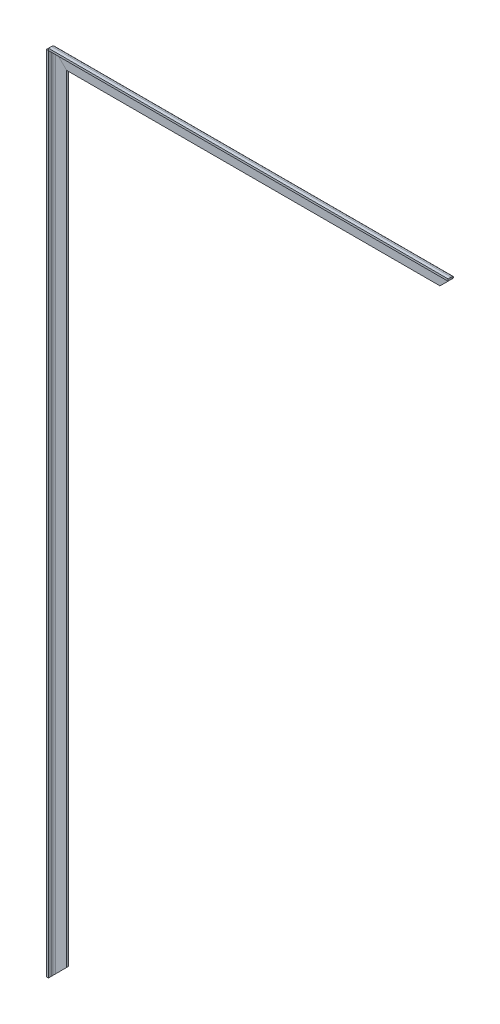
ISO-10303-21;
HEADER;
FILE_DESCRIPTION(('STEP AP214'),'2;1');
FILE_NAME('part.step','',(''),(''),'','','');
FILE_SCHEMA(('AUTOMOTIVE_DESIGN { 1 0 10303 214 1 1 1 1 }'));
ENDSEC;
DATA;
#1=APPLICATION_CONTEXT('core data for automotive mechanical design processes');
#2=APPLICATION_PROTOCOL_DEFINITION('international standard','automotive_design',2000,#1);
#3=PRODUCT_CONTEXT('',#1,'mechanical');
#4=PRODUCT('Part','Part','',(#3));
#5=PRODUCT_RELATED_PRODUCT_CATEGORY('part','',(#4));
#6=PRODUCT_DEFINITION_FORMATION('','',#4);
#7=PRODUCT_DEFINITION_CONTEXT('part definition',#1,'design');
#8=PRODUCT_DEFINITION('design','',#6,#7);
#9=PRODUCT_DEFINITION_SHAPE('','',#8);
#10=(LENGTH_UNIT() NAMED_UNIT(*) SI_UNIT(.MILLI.,.METRE.));
#11=(NAMED_UNIT(*) PLANE_ANGLE_UNIT() SI_UNIT($,.RADIAN.));
#12=(NAMED_UNIT(*) SI_UNIT($,.STERADIAN.) SOLID_ANGLE_UNIT());
#13=UNCERTAINTY_MEASURE_WITH_UNIT(LENGTH_MEASURE(1.E-05),#10,'distance_accuracy_value','');
#14=(GEOMETRIC_REPRESENTATION_CONTEXT(3) GLOBAL_UNCERTAINTY_ASSIGNED_CONTEXT((#13)) GLOBAL_UNIT_ASSIGNED_CONTEXT((#10,
#11,#12)) REPRESENTATION_CONTEXT('',''));
#15=CARTESIAN_POINT('',(0.,0.,0.));
#16=DIRECTION('',(0.,0.,1.));
#17=DIRECTION('',(1.,0.,0.));
#18=AXIS2_PLACEMENT_3D('',#15,#16,#17);
#19=CARTESIAN_POINT('',(212.481172589343,400.,-5.));
#20=DIRECTION('',(0.,0.,-1.));
#21=DIRECTION('',(0.,1.,0.));
#22=AXIS2_PLACEMENT_3D('',#19,#20,#21);
#23=PLANE('',#22);
#24=DIRECTION('',(0.707106781186547,0.707106781186548,0.));
#25=VECTOR('',#24,1.);
#26=CARTESIAN_POINT('',(206.240586294672,406.240586294672,-5.));
#27=LINE('',#26,#25);
#28=CARTESIAN_POINT('',(185.,385.,-5.));
#29=VERTEX_POINT('',#28);
#30=CARTESIAN_POINT('',(196.,396.,-5.));
#31=VERTEX_POINT('',#30);
#32=EDGE_CURVE('E82',#29,#31,#27,.T.);
#33=ORIENTED_EDGE('',*,*,#32,.T.);
#34=DIRECTION('',(-1.,0.,0.));
#35=VECTOR('',#34,1.);
#36=CARTESIAN_POINT('',(212.481172589343,396.,-5.));
#37=LINE('',#36,#35);
#38=CARTESIAN_POINT('',(-196.,396.,-5.));
#39=VERTEX_POINT('',#38);
#40=EDGE_CURVE('E130',#31,#39,#37,.T.);
#41=ORIENTED_EDGE('',*,*,#40,.T.);
#42=DIRECTION('',(0.707106781186548,-0.707106781186547,0.));
#43=VECTOR('',#42,1.);
#44=CARTESIAN_POINT('',(-206.240586294672,406.240586294672,-5.));
#45=LINE('',#44,#43);
#46=CARTESIAN_POINT('',(-185.,385.,-5.));
#47=VERTEX_POINT('',#46);
#48=EDGE_CURVE('E153',#39,#47,#45,.T.);
#49=ORIENTED_EDGE('',*,*,#48,.T.);
#50=DIRECTION('',(-1.,0.,0.));
#51=VECTOR('',#50,1.);
#52=CARTESIAN_POINT('',(212.481172589343,385.,-5.));
#53=LINE('',#52,#51);
#54=EDGE_CURVE('E12',#29,#47,#53,.T.);
#55=ORIENTED_EDGE('',*,*,#54,.F.);
#56=EDGE_LOOP('',(#33,#41,#49,#55));
#57=FACE_BOUND('',#56,.T.);
#58=ADVANCED_FACE('F47',(#57),#23,.F.);
#59=CARTESIAN_POINT('',(212.481172589343,385.,-7.));
#60=DIRECTION('',(0.,-1.,0.));
#61=DIRECTION('',(0.,0.,-1.));
#62=AXIS2_PLACEMENT_3D('',#59,#60,#61);
#63=PLANE('',#62);
#64=DIRECTION('',(-1.,0.,0.));
#65=VECTOR('',#64,1.);
#66=CARTESIAN_POINT('',(212.481172589343,385.,-7.));
#67=LINE('',#66,#65);
#68=CARTESIAN_POINT('',(185.,385.,-7.));
#69=VERTEX_POINT('',#68);
#70=CARTESIAN_POINT('',(-185.,385.,-7.));
#71=VERTEX_POINT('',#70);
#72=EDGE_CURVE('E56',#69,#71,#67,.T.);
#73=ORIENTED_EDGE('',*,*,#72,.F.);
#74=DIRECTION('',(0.,0.,1.));
#75=VECTOR('',#74,1.);
#76=CARTESIAN_POINT('',(185.,385.,-5.));
#77=LINE('',#76,#75);
#78=EDGE_CURVE('E72',#29,#69,#77,.F.);
#79=ORIENTED_EDGE('',*,*,#78,.F.);
#80=ORIENTED_EDGE('',*,*,#54,.T.);
#81=DIRECTION('',(0.,0.,1.));
#82=VECTOR('',#81,1.);
#83=CARTESIAN_POINT('',(-185.,385.,-5.));
#84=LINE('',#83,#82);
#85=EDGE_CURVE('E171',#47,#71,#84,.F.);
#86=ORIENTED_EDGE('',*,*,#85,.T.);
#87=EDGE_LOOP('',(#73,#79,#80,#86));
#88=FACE_BOUND('',#87,.T.);
#89=ADVANCED_FACE('F207',(#88),#63,.T.);
#90=CARTESIAN_POINT('',(212.481172589343,400.,-7.));
#91=DIRECTION('',(0.,0.,-1.));
#92=DIRECTION('',(0.,1.,0.));
#93=AXIS2_PLACEMENT_3D('',#90,#91,#92);
#94=PLANE('',#93);
#95=DIRECTION('',(-1.,0.,0.));
#96=VECTOR('',#95,1.);
#97=CARTESIAN_POINT('',(212.481172589343,396.,-7.));
#98=LINE('',#97,#96);
#99=CARTESIAN_POINT('',(196.,396.,-7.));
#100=VERTEX_POINT('',#99);
#101=CARTESIAN_POINT('',(-196.,396.,-7.));
#102=VERTEX_POINT('',#101);
#103=EDGE_CURVE('E234',#100,#102,#98,.T.);
#104=ORIENTED_EDGE('',*,*,#103,.F.);
#105=DIRECTION('',(0.707106781186547,0.707106781186548,0.));
#106=VECTOR('',#105,1.);
#107=CARTESIAN_POINT('',(206.240586294672,406.240586294672,-7.));
#108=LINE('',#107,#106);
#109=EDGE_CURVE('E215',#69,#100,#108,.T.);
#110=ORIENTED_EDGE('',*,*,#109,.F.);
#111=ORIENTED_EDGE('',*,*,#72,.T.);
#112=DIRECTION('',(0.707106781186548,-0.707106781186547,0.));
#113=VECTOR('',#112,1.);
#114=CARTESIAN_POINT('',(-206.240586294672,406.240586294672,-7.));
#115=LINE('',#114,#113);
#116=EDGE_CURVE('E166',#102,#71,#115,.T.);
#117=ORIENTED_EDGE('',*,*,#116,.F.);
#118=EDGE_LOOP('',(#104,#110,#111,#117));
#119=FACE_BOUND('',#118,.T.);
#120=ADVANCED_FACE('F212',(#119),#94,.T.);
#121=CARTESIAN_POINT('',(212.481172589343,396.,-3.));
#122=DIRECTION('',(-1.,0.,0.));
#123=DIRECTION('',(0.,0.,1.));
#124=AXIS2_PLACEMENT_3D('',#121,#122,#123);
#125=CYLINDRICAL_SURFACE('',#124,4.);
#126=DIRECTION('',(-1.,0.,0.));
#127=VECTOR('',#126,1.);
#128=CARTESIAN_POINT('',(212.481172589343,400.,-3.));
#129=LINE('',#128,#127);
#130=CARTESIAN_POINT('',(198.,400.,-3.));
#131=VERTEX_POINT('',#130);
#132=CARTESIAN_POINT('',(-198.,400.,-3.));
#133=VERTEX_POINT('',#132);
#134=EDGE_CURVE('E50',#131,#133,#129,.T.);
#135=ORIENTED_EDGE('',*,*,#134,.F.);
#136=CARTESIAN_POINT('',(198.,400.,-3.));
#137=CARTESIAN_POINT('',(198.000008141839,400.000016283522,-3.10254881103447));
#138=CARTESIAN_POINT('',(197.998028553546,399.996057106996,-3.20509176757879));
#139=CARTESIAN_POINT('',(197.990154063986,399.98030812807,-3.40939798445757));
#140=CARTESIAN_POINT('',(197.984260156687,399.968520313604,-3.51116143609841));
#141=CARTESIAN_POINT('',(197.968643700078,399.937287400362,-3.71285018763311));
#142=CARTESIAN_POINT('',(197.95893422969,399.917868459432,-3.81278055890371));
#143=CARTESIAN_POINT('',(197.935798612536,399.871597225021,-4.01046499524275));
#144=CARTESIAN_POINT('',(197.922372356002,399.844744712006,-4.1082189959452));
#145=CARTESIAN_POINT('',(197.891958328532,399.783916657062,-4.30083179794626));
#146=CARTESIAN_POINT('',(197.874973365915,399.749946731773,-4.39569281499673));
#147=CARTESIAN_POINT('',(197.837612598693,399.675225197443,-4.58202809749169));
#148=CARTESIAN_POINT('',(197.81723556678,399.634471133787,-4.67350112240628));
#149=CARTESIAN_POINT('',(197.751293334853,399.502586670121,-4.94205858430971));
#150=CARTESIAN_POINT('',(197.700905589006,399.401811178124,-5.11335277311302));
#151=CARTESIAN_POINT('',(197.58606170121,399.172123402302,-5.44554026269115));
#152=CARTESIAN_POINT('',(197.520987952832,399.041975905638,-5.60535608628226));
#153=CARTESIAN_POINT('',(197.38074302363,398.761486047299,-5.9009883788655));
#154=CARTESIAN_POINT('',(197.305569307113,398.611138614235,-6.03679880117894));
#155=CARTESIAN_POINT('',(197.139393189424,398.278786378836,-6.29479062678182));
#156=CARTESIAN_POINT('',(197.047560638042,398.095121276084,-6.41429643768422));
#157=CARTESIAN_POINT('',(196.856828013084,397.713656026182,-6.62084503824152));
#158=CARTESIAN_POINT('',(196.757921818155,397.515843636323,-6.70785929539006));
#159=CARTESIAN_POINT('',(196.55048538301,397.100970766007,-6.85206051205564));
#160=CARTESIAN_POINT('',(196.441721037479,396.883442074917,-6.90757750779627));
#161=CARTESIAN_POINT('',(196.276898380014,396.553796760002,-6.96304691099694));
#162=CARTESIAN_POINT('',(196.22170271407,396.44340542813,-6.976902373857));
#163=CARTESIAN_POINT('',(196.111011910332,396.222023820674,-6.99537483670975));
#164=CARTESIAN_POINT('',(196.055516823423,396.111033646862,-6.99999335980574));
#165=CARTESIAN_POINT('',(196.,396.,-7.));
#166=B_SPLINE_CURVE_WITH_KNOTS('',3,(#136,#137,#138,#139,#140,#141,#142,#143,#144,#145,#146,
#147,#148,#149,#150,#151,#152,#153,#154,#155,#156,#157,#158,#159,#160,#161,#162,#163,#164,#165),
.UNSPECIFIED.,.F.,.F.,(4,2,2,2,2,2,2,2,2,2,2,2,2,2,4),(0.,0.307541825689421,0.615005586813074,
0.921424495160893,1.2278524538173,1.53403950229312,1.84033757610272,2.45270899448754,
3.09849344524381,3.74444033042885,4.45426006995498,5.16470168096082,5.90994576106208,
6.28224135766716,6.65447556040841),.UNSPECIFIED.);
#167=EDGE_CURVE('E218',#131,#100,#166,.T.);
#168=ORIENTED_EDGE('',*,*,#167,.T.);
#169=ORIENTED_EDGE('',*,*,#103,.T.);
#170=CARTESIAN_POINT('',(-198.,400.,-3.));
#171=CARTESIAN_POINT('',(-198.000000692802,400.000001385607,-3.0835917984714));
#172=CARTESIAN_POINT('',(-197.998689072273,399.997378144548,-3.16715448025951));
#173=CARTESIAN_POINT('',(-197.9934565244,399.986913048799,-3.3339384749692));
#174=CARTESIAN_POINT('',(-197.989533487185,399.979066974369,-3.41715945706977));
#175=CARTESIAN_POINT('',(-197.973788722936,399.947577445875,-3.66702609453617));
#176=CARTESIAN_POINT('',(-197.957991523184,399.915983046386,-3.83250562468461));
#177=CARTESIAN_POINT('',(-197.916331943118,399.832663886254,-4.1570850029729));
#178=CARTESIAN_POINT('',(-197.890458555382,399.780917110767,-4.31617766359243));
#179=CARTESIAN_POINT('',(-197.822731676555,399.645463353106,-4.65874281867934));
#180=CARTESIAN_POINT('',(-197.778628424606,399.557256849222,-4.84001017328866));
#181=CARTESIAN_POINT('',(-197.678270003785,399.356540007583,-5.18483927812948));
#182=CARTESIAN_POINT('',(-197.622007977371,399.244015954746,-5.34839095826477));
#183=CARTESIAN_POINT('',(-197.494972719605,398.989945439205,-5.66538059265281));
#184=CARTESIAN_POINT('',(-197.42346777333,398.84693554666,-5.81735021235024));
#185=CARTESIAN_POINT('',(-197.271006585118,398.542013170238,-6.09528302116723));
#186=CARTESIAN_POINT('',(-197.190047496878,398.380094993757,-6.22123834655656));
#187=CARTESIAN_POINT('',(-197.012132944059,398.024265888118,-6.45723761979333));
#188=CARTESIAN_POINT('',(-196.914388757438,397.828777514877,-6.56430583734997));
#189=CARTESIAN_POINT('',(-196.712731926499,397.425463853001,-6.74390277575413));
#190=CARTESIAN_POINT('',(-196.608816993691,397.217633987384,-6.81641859134203));
#191=CARTESIAN_POINT('',(-196.420625602938,396.841251205875,-6.91425281907048));
#192=CARTESIAN_POINT('',(-196.337045624938,396.674091249871,-6.94643751359952));
#193=CARTESIAN_POINT('',(-196.168979465261,396.337958930515,-6.98928895406009));
#194=CARTESIAN_POINT('',(-196.084495759251,396.168991518496,-7.00000417870206));
#195=CARTESIAN_POINT('',(-196.,396.,-7.));
#196=B_SPLINE_CURVE_WITH_KNOTS('',3,(#170,#171,#172,#173,#174,#175,#176,#177,#178,#179,#180,
#181,#182,#183,#184,#185,#186,#187,#188,#189,#190,#191,#192,#193,#194,#195),.UNSPECIFIED.,.F.,
.F.,(4,2,2,2,2,2,2,2,2,2,2,2,4),(0.,0.250666545733119,0.501535861457153,1.00734763625018,
1.51371352659262,2.13000670805729,2.74664838987587,3.40568378374192,4.06491810346928,
4.79206298138847,5.51947923412776,6.08721424431558,6.65366584045101),.UNSPECIFIED.);
#197=EDGE_CURVE('E174',#133,#102,#196,.T.);
#198=ORIENTED_EDGE('',*,*,#197,.F.);
#199=EDGE_LOOP('',(#135,#168,#169,#198));
#200=FACE_BOUND('',#199,.T.);
#201=ADVANCED_FACE('F259',(#200),#125,.T.);
#202=CARTESIAN_POINT('',(212.481172589343,400.,0.));
#203=DIRECTION('',(0.,1.,0.));
#204=DIRECTION('',(0.,0.,1.));
#205=AXIS2_PLACEMENT_3D('',#202,#203,#204);
#206=PLANE('',#205);
#207=DIRECTION('',(-1.,0.,0.));
#208=VECTOR('',#207,1.);
#209=CARTESIAN_POINT('',(212.481172589343,400.,0.));
#210=LINE('',#209,#208);
#211=CARTESIAN_POINT('',(198.,400.,0.));
#212=VERTEX_POINT('',#211);
#213=CARTESIAN_POINT('',(-198.,400.,0.));
#214=VERTEX_POINT('',#213);
#215=EDGE_CURVE('E231',#212,#214,#210,.T.);
#216=ORIENTED_EDGE('',*,*,#215,.F.);
#217=DIRECTION('',(0.,0.,1.));
#218=VECTOR('',#217,1.);
#219=CARTESIAN_POINT('',(198.,400.,0.));
#220=LINE('',#219,#218);
#221=EDGE_CURVE('E89',#131,#212,#220,.T.);
#222=ORIENTED_EDGE('',*,*,#221,.F.);
#223=ORIENTED_EDGE('',*,*,#134,.T.);
#224=DIRECTION('',(0.,0.,-1.));
#225=VECTOR('',#224,1.);
#226=CARTESIAN_POINT('',(-198.,400.,0.));
#227=LINE('',#226,#225);
#228=EDGE_CURVE('E152',#214,#133,#227,.T.);
#229=ORIENTED_EDGE('',*,*,#228,.F.);
#230=EDGE_LOOP('',(#216,#222,#223,#229));
#231=FACE_BOUND('',#230,.T.);
#232=ADVANCED_FACE('F256',(#231),#206,.T.);
#233=CARTESIAN_POINT('',(212.481172589343,398.,0.));
#234=DIRECTION('',(0.,0.,1.));
#235=DIRECTION('',(1.,0.,0.));
#236=AXIS2_PLACEMENT_3D('',#233,#234,#235);
#237=PLANE('',#236);
#238=DIRECTION('',(-1.,0.,0.));
#239=VECTOR('',#238,1.);
#240=CARTESIAN_POINT('',(212.481172589343,398.,0.));
#241=LINE('',#240,#239);
#242=CARTESIAN_POINT('',(198.,398.,0.));
#243=VERTEX_POINT('',#242);
#244=CARTESIAN_POINT('',(-198.,398.,0.));
#245=VERTEX_POINT('',#244);
#246=EDGE_CURVE('E129',#243,#245,#241,.T.);
#247=ORIENTED_EDGE('',*,*,#246,.F.);
#248=DIRECTION('',(0.,-1.,0.));
#249=VECTOR('',#248,1.);
#250=CARTESIAN_POINT('',(198.,398.,0.));
#251=LINE('',#250,#249);
#252=EDGE_CURVE('E216',#243,#212,#251,.F.);
#253=ORIENTED_EDGE('',*,*,#252,.T.);
#254=ORIENTED_EDGE('',*,*,#215,.T.);
#255=DIRECTION('',(0.,-1.,0.));
#256=VECTOR('',#255,1.);
#257=CARTESIAN_POINT('',(-198.,398.,0.));
#258=LINE('',#257,#256);
#259=EDGE_CURVE('E154',#245,#214,#258,.F.);
#260=ORIENTED_EDGE('',*,*,#259,.F.);
#261=EDGE_LOOP('',(#247,#253,#254,#260));
#262=FACE_BOUND('',#261,.T.);
#263=ADVANCED_FACE('F253',(#262),#237,.T.);
#264=CARTESIAN_POINT('',(212.481172589343,398.,0.));
#265=DIRECTION('',(0.,1.,0.));
#266=DIRECTION('',(0.,0.,1.));
#267=AXIS2_PLACEMENT_3D('',#264,#265,#266);
#268=PLANE('',#267);
#269=DIRECTION('',(0.,0.,1.));
#270=VECTOR('',#269,1.);
#271=CARTESIAN_POINT('',(198.,398.,0.));
#272=LINE('',#271,#270);
#273=CARTESIAN_POINT('',(198.,398.,-3.));
#274=VERTEX_POINT('',#273);
#275=EDGE_CURVE('E248',#274,#243,#272,.T.);
#276=ORIENTED_EDGE('',*,*,#275,.T.);
#277=ORIENTED_EDGE('',*,*,#246,.T.);
#278=DIRECTION('',(0.,0.,-1.));
#279=VECTOR('',#278,1.);
#280=CARTESIAN_POINT('',(-198.,398.,0.));
#281=LINE('',#280,#279);
#282=CARTESIAN_POINT('',(-198.,398.,-3.));
#283=VERTEX_POINT('',#282);
#284=EDGE_CURVE('E143',#245,#283,#281,.T.);
#285=ORIENTED_EDGE('',*,*,#284,.T.);
#286=DIRECTION('',(-1.,0.,0.));
#287=VECTOR('',#286,1.);
#288=CARTESIAN_POINT('',(212.481172589343,398.,-3.));
#289=LINE('',#288,#287);
#290=EDGE_CURVE('E120',#274,#283,#289,.T.);
#291=ORIENTED_EDGE('',*,*,#290,.F.);
#292=EDGE_LOOP('',(#276,#277,#285,#291));
#293=FACE_BOUND('',#292,.T.);
#294=ADVANCED_FACE('F156',(#293),#268,.F.);
#295=CARTESIAN_POINT('',(212.481172589343,396.,-3.));
#296=DIRECTION('',(-1.,0.,0.));
#297=DIRECTION('',(0.,0.,1.));
#298=AXIS2_PLACEMENT_3D('',#295,#296,#297);
#299=CYLINDRICAL_SURFACE('',#298,2.);
#300=CARTESIAN_POINT('',(196.,396.,-3.));
#301=DIRECTION('',(-0.707106781186548,0.707106781186547,0.));
#302=DIRECTION('',(-0.707106781186547,-0.707106781186548,0.));
#303=AXIS2_PLACEMENT_3D('',#300,#301,#302);
#304=ELLIPSE('',#303,2.82842712474619,2.);
#305=EDGE_CURVE('E125',#31,#274,#304,.F.);
#306=ORIENTED_EDGE('',*,*,#305,.T.);
#307=ORIENTED_EDGE('',*,*,#290,.T.);
#308=CARTESIAN_POINT('',(-196.,396.,-3.));
#309=DIRECTION('',(-0.707106781186547,-0.707106781186548,0.));
#310=DIRECTION('',(0.707106781186548,-0.707106781186547,0.));
#311=AXIS2_PLACEMENT_3D('',#308,#309,#310);
#312=ELLIPSE('',#311,2.82842712474619,2.);
#313=EDGE_CURVE('E124',#283,#39,#312,.T.);
#314=ORIENTED_EDGE('',*,*,#313,.T.);
#315=ORIENTED_EDGE('',*,*,#40,.F.);
#316=EDGE_LOOP('',(#306,#307,#314,#315));
#317=FACE_BOUND('',#316,.T.);
#318=ADVANCED_FACE('F122',(#317),#299,.F.);
#319=CARTESIAN_POINT('',(206.240586294672,406.240586294672,-5.));
#320=DIRECTION('',(-0.707106781186548,0.707106781186547,0.));
#321=DIRECTION('',(0.707106781186547,0.707106781186548,0.));
#322=AXIS2_PLACEMENT_3D('',#319,#320,#321);
#323=PLANE('',#322);
#324=DIRECTION('',(0.,0.,1.));
#325=VECTOR('',#324,1.);
#326=CARTESIAN_POINT('',(196.,396.,-5.));
#327=LINE('',#326,#325);
#328=EDGE_CURVE('E221',#31,#100,#327,.F.);
#329=ORIENTED_EDGE('',*,*,#328,.F.);
#330=ORIENTED_EDGE('',*,*,#32,.F.);
#331=ORIENTED_EDGE('',*,*,#78,.T.);
#332=ORIENTED_EDGE('',*,*,#109,.T.);
#333=EDGE_LOOP('',(#329,#330,#331,#332));
#334=FACE_BOUND('',#333,.T.);
#335=ADVANCED_FACE('F262',(#334),#323,.F.);
#336=CARTESIAN_POINT('',(198.,398.,0.));
#337=DIRECTION('',(-1.,0.,0.));
#338=DIRECTION('',(0.,0.,1.));
#339=AXIS2_PLACEMENT_3D('',#336,#337,#338);
#340=PLANE('',#339);
#341=ORIENTED_EDGE('',*,*,#252,.F.);
#342=ORIENTED_EDGE('',*,*,#275,.F.);
#343=DIRECTION('',(0.,-1.,0.));
#344=VECTOR('',#343,1.);
#345=CARTESIAN_POINT('',(198.,398.,-3.));
#346=LINE('',#345,#344);
#347=EDGE_CURVE('E63',#274,#131,#346,.F.);
#348=ORIENTED_EDGE('',*,*,#347,.T.);
#349=ORIENTED_EDGE('',*,*,#221,.T.);
#350=EDGE_LOOP('',(#341,#342,#348,#349));
#351=FACE_BOUND('',#350,.T.);
#352=ADVANCED_FACE('F260',(#351),#340,.F.);
#353=CARTESIAN_POINT('',(194.,391.8,-3.));
#354=CARTESIAN_POINT('',(194.,392.533333333333,-3.));
#355=CARTESIAN_POINT('',(194.,393.266666666667,-3.));
#356=CARTESIAN_POINT('',(194.,394.,-3.));
#357=CARTESIAN_POINT('',(194.,391.8,-11.4));
#358=CARTESIAN_POINT('',(194.,392.533333333333,-9.93333333333334));
#359=CARTESIAN_POINT('',(194.,393.266666666667,-8.46666666666667));
#360=CARTESIAN_POINT('',(194.,394.,-7.));
#361=CARTESIAN_POINT('',(198.,400.2,-11.4));
#362=CARTESIAN_POINT('',(198.,399.466666666667,-9.93333333333334));
#363=CARTESIAN_POINT('',(198.,398.733333333333,-8.46666666666667));
#364=CARTESIAN_POINT('',(198.,398.,-7.));
#365=CARTESIAN_POINT('',(198.,400.2,-3.));
#366=CARTESIAN_POINT('',(198.,399.466666666667,-3.));
#367=CARTESIAN_POINT('',(198.,398.733333333333,-3.));
#368=CARTESIAN_POINT('',(198.,398.,-3.));
#369=CARTESIAN_POINT('',(198.,400.2,5.4));
#370=CARTESIAN_POINT('',(198.,399.466666666667,3.93333333333333));
#371=CARTESIAN_POINT('',(198.,398.733333333333,2.46666666666667));
#372=CARTESIAN_POINT('',(198.,398.,0.999999999999999));
#373=CARTESIAN_POINT('',(194.,391.8,5.4));
#374=CARTESIAN_POINT('',(194.,392.533333333333,3.93333333333333));
#375=CARTESIAN_POINT('',(194.,393.266666666667,2.46666666666667));
#376=CARTESIAN_POINT('',(194.,394.,0.999999999999999));
#377=CARTESIAN_POINT('',(194.,391.8,-3.));
#378=CARTESIAN_POINT('',(194.,392.533333333333,-3.));
#379=CARTESIAN_POINT('',(194.,393.266666666667,-3.));
#380=CARTESIAN_POINT('',(194.,394.,-3.));
#381=(BOUNDED_SURFACE() B_SPLINE_SURFACE(3,3,((#353,#354,#355,#356),(#357,#358,#359,#360),(#361,
#362,#363,#364),(#365,#366,#367,#368),(#369,#370,#371,#372),(#373,#374,#375,#376),(#377,#378,
#379,#380)),.UNSPECIFIED.,.T.,.F.,.F.) B_SPLINE_SURFACE_WITH_KNOTS((4,3,4),(4,4),(0.,0.5,1.),
(0.,1.),.UNSPECIFIED.) GEOMETRIC_REPRESENTATION_ITEM() RATIONAL_B_SPLINE_SURFACE(((1.,1.,1.,1.),
(0.333333333333333,0.333333333333333,0.333333333333333,0.333333333333333),(0.333333333333333,
0.333333333333333,0.333333333333333,0.333333333333333),(1.,1.,1.,1.),(0.333333333333333,
0.333333333333333,0.333333333333333,0.333333333333333),(0.333333333333333,0.333333333333333,
0.333333333333333,0.333333333333333),(1.,1.,1.,1.))) REPRESENTATION_ITEM('') SURFACE());
#382=ORIENTED_EDGE('',*,*,#347,.F.);
#383=ORIENTED_EDGE('',*,*,#305,.F.);
#384=ORIENTED_EDGE('',*,*,#328,.T.);
#385=ORIENTED_EDGE('',*,*,#167,.F.);
#386=EDGE_LOOP('',(#382,#383,#384,#385));
#387=FACE_BOUND('',#386,.T.);
#388=ADVANCED_FACE('F194',(#387),#381,.T.);
#389=CARTESIAN_POINT('',(-194.,394.,-3.));
#390=CARTESIAN_POINT('',(-194.,393.3,-3.));
#391=CARTESIAN_POINT('',(-194.,392.6,-3.));
#392=CARTESIAN_POINT('',(-194.,391.9,-3.));
#393=CARTESIAN_POINT('',(-194.,394.,0.999999999999999));
#394=CARTESIAN_POINT('',(-194.,393.3,2.4));
#395=CARTESIAN_POINT('',(-194.,392.6,3.8));
#396=CARTESIAN_POINT('',(-194.,391.9,5.2));
#397=CARTESIAN_POINT('',(-198.,398.,0.999999999999999));
#398=CARTESIAN_POINT('',(-198.,398.7,2.4));
#399=CARTESIAN_POINT('',(-198.,399.4,3.8));
#400=CARTESIAN_POINT('',(-198.,400.1,5.2));
#401=CARTESIAN_POINT('',(-198.,398.,-3.));
#402=CARTESIAN_POINT('',(-198.,398.7,-3.));
#403=CARTESIAN_POINT('',(-198.,399.4,-3.));
#404=CARTESIAN_POINT('',(-198.,400.1,-3.));
#405=CARTESIAN_POINT('',(-198.,398.,-7.));
#406=CARTESIAN_POINT('',(-198.,398.7,-8.4));
#407=CARTESIAN_POINT('',(-198.,399.4,-9.8));
#408=CARTESIAN_POINT('',(-198.,400.1,-11.2));
#409=CARTESIAN_POINT('',(-194.,394.,-7.));
#410=CARTESIAN_POINT('',(-194.,393.3,-8.4));
#411=CARTESIAN_POINT('',(-194.,392.6,-9.8));
#412=CARTESIAN_POINT('',(-194.,391.9,-11.2));
#413=CARTESIAN_POINT('',(-194.,394.,-3.));
#414=CARTESIAN_POINT('',(-194.,393.3,-3.));
#415=CARTESIAN_POINT('',(-194.,392.6,-3.));
#416=CARTESIAN_POINT('',(-194.,391.9,-3.));
#417=(BOUNDED_SURFACE() B_SPLINE_SURFACE(3,3,((#389,#390,#391,#392),(#393,#394,#395,#396),(#397,
#398,#399,#400),(#401,#402,#403,#404),(#405,#406,#407,#408),(#409,#410,#411,#412),(#413,#414,
#415,#416)),.UNSPECIFIED.,.T.,.F.,.F.) B_SPLINE_SURFACE_WITH_KNOTS((4,3,4),(4,4),(0.,0.5,1.),
(0.,1.),.UNSPECIFIED.) GEOMETRIC_REPRESENTATION_ITEM() RATIONAL_B_SPLINE_SURFACE(((1.,1.,1.,1.),
(0.333333333333333,0.333333333333333,0.333333333333333,0.333333333333333),(0.333333333333333,
0.333333333333333,0.333333333333333,0.333333333333333),(1.,1.,1.,1.),(0.333333333333333,
0.333333333333333,0.333333333333333,0.333333333333333),(0.333333333333333,0.333333333333333,
0.333333333333333,0.333333333333333),(1.,1.,1.,1.))) REPRESENTATION_ITEM('') SURFACE());
#418=DIRECTION('',(0.,0.,1.));
#419=VECTOR('',#418,1.);
#420=CARTESIAN_POINT('',(-196.,396.,-5.));
#421=LINE('',#420,#419);
#422=EDGE_CURVE('E141',#39,#102,#421,.F.);
#423=DIRECTION('',(0.,-1.,0.));
#424=VECTOR('',#423,1.);
#425=CARTESIAN_POINT('',(-198.,398.,-3.));
#426=LINE('',#425,#424);
#427=EDGE_CURVE('E138',#283,#133,#426,.F.);
#428=ORIENTED_EDGE('',*,*,#197,.T.);
#429=ORIENTED_EDGE('',*,*,#422,.F.);
#430=ORIENTED_EDGE('',*,*,#313,.F.);
#431=ORIENTED_EDGE('',*,*,#427,.T.);
#432=EDGE_LOOP('',(#428,#429,#430,#431));
#433=FACE_BOUND('',#432,.T.);
#434=ADVANCED_FACE('F137',(#433),#417,.F.);
#435=CARTESIAN_POINT('',(-206.240586294672,406.240586294672,-5.));
#436=DIRECTION('',(-0.707106781186547,-0.707106781186548,0.));
#437=DIRECTION('',(0.707106781186548,-0.707106781186547,0.));
#438=AXIS2_PLACEMENT_3D('',#435,#436,#437);
#439=PLANE('',#438);
#440=ORIENTED_EDGE('',*,*,#85,.F.);
#441=ORIENTED_EDGE('',*,*,#48,.F.);
#442=ORIENTED_EDGE('',*,*,#422,.T.);
#443=ORIENTED_EDGE('',*,*,#116,.T.);
#444=EDGE_LOOP('',(#440,#441,#442,#443));
#445=FACE_BOUND('',#444,.T.);
#446=ADVANCED_FACE('F193',(#445),#439,.T.);
#447=CARTESIAN_POINT('',(-198.,398.,0.));
#448=DIRECTION('',(-1.,0.,0.));
#449=DIRECTION('',(0.,0.,-1.));
#450=AXIS2_PLACEMENT_3D('',#447,#448,#449);
#451=PLANE('',#450);
#452=ORIENTED_EDGE('',*,*,#427,.F.);
#453=ORIENTED_EDGE('',*,*,#284,.F.);
#454=ORIENTED_EDGE('',*,*,#259,.T.);
#455=ORIENTED_EDGE('',*,*,#228,.T.);
#456=EDGE_LOOP('',(#452,#453,#454,#455));
#457=FACE_BOUND('',#456,.T.);
#458=ADVANCED_FACE('F148',(#457),#451,.T.);
#459=CLOSED_SHELL('',(#58,#89,#120,#201,#232,#263,#294,#318,#335,#352,#388,#434,#446,#458));
#460=MANIFOLD_SOLID_BREP('B2',#459);
#461=CARTESIAN_POINT('',(-200.,412.481172589343,-5.));
#462=DIRECTION('',(0.,0.,-1.));
#463=DIRECTION('',(-1.,0.,0.));
#464=AXIS2_PLACEMENT_3D('',#461,#462,#463);
#465=PLANE('',#464);
#466=DIRECTION('',(-0.707106781186548,0.707106781186547,0.));
#467=VECTOR('',#466,1.);
#468=CARTESIAN_POINT('',(-206.240586294672,406.240586294672,-5.));
#469=LINE('',#468,#467);
#470=CARTESIAN_POINT('',(-185.,385.,-5.));
#471=VERTEX_POINT('',#470);
#472=CARTESIAN_POINT('',(-196.,396.,-5.));
#473=VERTEX_POINT('',#472);
#474=EDGE_CURVE('E433',#471,#473,#469,.T.);
#475=ORIENTED_EDGE('',*,*,#474,.T.);
#476=DIRECTION('',(0.,-1.,0.));
#477=VECTOR('',#476,1.);
#478=CARTESIAN_POINT('',(-196.,412.481172589343,-5.));
#479=LINE('',#478,#477);
#480=CARTESIAN_POINT('',(-196.,-396.,-5.));
#481=VERTEX_POINT('',#480);
#482=EDGE_CURVE('E481',#473,#481,#479,.T.);
#483=ORIENTED_EDGE('',*,*,#482,.T.);
#484=DIRECTION('',(0.707106781186547,0.707106781186548,0.));
#485=VECTOR('',#484,1.);
#486=CARTESIAN_POINT('',(-206.240586294672,-406.240586294672,-5.));
#487=LINE('',#486,#485);
#488=CARTESIAN_POINT('',(-185.,-385.,-5.));
#489=VERTEX_POINT('',#488);
#490=EDGE_CURVE('E504',#481,#489,#487,.T.);
#491=ORIENTED_EDGE('',*,*,#490,.T.);
#492=DIRECTION('',(0.,-1.,0.));
#493=VECTOR('',#492,1.);
#494=CARTESIAN_POINT('',(-185.,412.481172589343,-5.));
#495=LINE('',#494,#493);
#496=EDGE_CURVE('E45',#471,#489,#495,.T.);
#497=ORIENTED_EDGE('',*,*,#496,.F.);
#498=EDGE_LOOP('',(#475,#483,#491,#497));
#499=FACE_BOUND('',#498,.T.);
#500=ADVANCED_FACE('F398',(#499),#465,.F.);
#501=CARTESIAN_POINT('',(-185.,412.481172589343,-7.));
#502=DIRECTION('',(1.,0.,0.));
#503=DIRECTION('',(0.,0.,-1.));
#504=AXIS2_PLACEMENT_3D('',#501,#502,#503);
#505=PLANE('',#504);
#506=DIRECTION('',(0.,-1.,0.));
#507=VECTOR('',#506,1.);
#508=CARTESIAN_POINT('',(-185.,412.481172589343,-7.));
#509=LINE('',#508,#507);
#510=CARTESIAN_POINT('',(-185.,385.,-7.));
#511=VERTEX_POINT('',#510);
#512=CARTESIAN_POINT('',(-185.,-385.,-7.));
#513=VERTEX_POINT('',#512);
#514=EDGE_CURVE('E407',#511,#513,#509,.T.);
#515=ORIENTED_EDGE('',*,*,#514,.F.);
#516=DIRECTION('',(0.,0.,1.));
#517=VECTOR('',#516,1.);
#518=CARTESIAN_POINT('',(-185.,385.,-5.));
#519=LINE('',#518,#517);
#520=EDGE_CURVE('E423',#471,#511,#519,.F.);
#521=ORIENTED_EDGE('',*,*,#520,.F.);
#522=ORIENTED_EDGE('',*,*,#496,.T.);
#523=DIRECTION('',(0.,0.,1.));
#524=VECTOR('',#523,1.);
#525=CARTESIAN_POINT('',(-185.,-385.,-5.));
#526=LINE('',#525,#524);
#527=EDGE_CURVE('E522',#489,#513,#526,.F.);
#528=ORIENTED_EDGE('',*,*,#527,.T.);
#529=EDGE_LOOP('',(#515,#521,#522,#528));
#530=FACE_BOUND('',#529,.T.);
#531=ADVANCED_FACE('F558',(#530),#505,.T.);
#532=CARTESIAN_POINT('',(-200.,412.481172589343,-7.));
#533=DIRECTION('',(0.,0.,-1.));
#534=DIRECTION('',(-1.,0.,0.));
#535=AXIS2_PLACEMENT_3D('',#532,#533,#534);
#536=PLANE('',#535);
#537=DIRECTION('',(0.,-1.,0.));
#538=VECTOR('',#537,1.);
#539=CARTESIAN_POINT('',(-196.,412.481172589343,-7.));
#540=LINE('',#539,#538);
#541=CARTESIAN_POINT('',(-196.,396.,-7.));
#542=VERTEX_POINT('',#541);
#543=CARTESIAN_POINT('',(-196.,-396.,-7.));
#544=VERTEX_POINT('',#543);
#545=EDGE_CURVE('E585',#542,#544,#540,.T.);
#546=ORIENTED_EDGE('',*,*,#545,.F.);
#547=DIRECTION('',(-0.707106781186548,0.707106781186547,0.));
#548=VECTOR('',#547,1.);
#549=CARTESIAN_POINT('',(-206.240586294672,406.240586294672,-7.));
#550=LINE('',#549,#548);
#551=EDGE_CURVE('E566',#511,#542,#550,.T.);
#552=ORIENTED_EDGE('',*,*,#551,.F.);
#553=ORIENTED_EDGE('',*,*,#514,.T.);
#554=DIRECTION('',(0.707106781186547,0.707106781186548,0.));
#555=VECTOR('',#554,1.);
#556=CARTESIAN_POINT('',(-206.240586294672,-406.240586294672,-7.));
#557=LINE('',#556,#555);
#558=EDGE_CURVE('E517',#544,#513,#557,.T.);
#559=ORIENTED_EDGE('',*,*,#558,.F.);
#560=EDGE_LOOP('',(#546,#552,#553,#559));
#561=FACE_BOUND('',#560,.T.);
#562=ADVANCED_FACE('F563',(#561),#536,.T.);
#563=CARTESIAN_POINT('',(-196.,412.481172589343,-3.));
#564=DIRECTION('',(0.,-1.,0.));
#565=DIRECTION('',(0.,0.,-1.));
#566=AXIS2_PLACEMENT_3D('',#563,#564,#565);
#567=CYLINDRICAL_SURFACE('',#566,4.);
#568=DIRECTION('',(0.,-1.,0.));
#569=VECTOR('',#568,1.);
#570=CARTESIAN_POINT('',(-200.,412.481172589343,-3.));
#571=LINE('',#570,#569);
#572=CARTESIAN_POINT('',(-200.,398.,-3.));
#573=VERTEX_POINT('',#572);
#574=CARTESIAN_POINT('',(-200.,-398.,-3.));
#575=VERTEX_POINT('',#574);
#576=EDGE_CURVE('E401',#573,#575,#571,.T.);
#577=ORIENTED_EDGE('',*,*,#576,.F.);
#578=CARTESIAN_POINT('',(-200.,398.,-3.));
#579=CARTESIAN_POINT('',(-200.000016283522,398.000008141839,-3.10254881103446));
#580=CARTESIAN_POINT('',(-199.996057106996,397.998028553546,-3.20509176757879));
#581=CARTESIAN_POINT('',(-199.98030812807,397.990154063986,-3.4093979844576));
#582=CARTESIAN_POINT('',(-199.968520313604,397.984260156687,-3.51116143609845));
#583=CARTESIAN_POINT('',(-199.937287400362,397.968643700078,-3.71285018763315));
#584=CARTESIAN_POINT('',(-199.917868459432,397.95893422969,-3.81278055890373));
#585=CARTESIAN_POINT('',(-199.871597225021,397.935798612536,-4.01046499524279));
#586=CARTESIAN_POINT('',(-199.844744712007,397.922372356003,-4.10821899594528));
#587=CARTESIAN_POINT('',(-199.783916657062,397.891958328532,-4.30083179794631));
#588=CARTESIAN_POINT('',(-199.749946731773,397.874973365915,-4.39569281499672));
#589=CARTESIAN_POINT('',(-199.675225197443,397.837612598693,-4.58202809749165));
#590=CARTESIAN_POINT('',(-199.634471133787,397.81723556678,-4.67350112240628));
#591=CARTESIAN_POINT('',(-199.502586670121,397.751293334853,-4.94205858430977));
#592=CARTESIAN_POINT('',(-199.401811178124,397.700905589006,-5.11335277311305));
#593=CARTESIAN_POINT('',(-199.172123402302,397.58606170121,-5.44554026269115));
#594=CARTESIAN_POINT('',(-199.041975905638,397.520987952832,-5.60535608628225));
#595=CARTESIAN_POINT('',(-198.761486047299,397.38074302363,-5.90098837886553));
#596=CARTESIAN_POINT('',(-198.611138614235,397.305569307113,-6.03679880117902));
#597=CARTESIAN_POINT('',(-198.278786378836,397.139393189424,-6.29479062678188));
#598=CARTESIAN_POINT('',(-198.095121276084,397.047560638042,-6.41429643768421));
#599=CARTESIAN_POINT('',(-197.713656026182,396.856828013085,-6.62084503824148));
#600=CARTESIAN_POINT('',(-197.515843636323,396.757921818155,-6.70785929539005));
#601=CARTESIAN_POINT('',(-197.100970766007,396.55048538301,-6.85206051205565));
#602=CARTESIAN_POINT('',(-196.883442074917,396.44172103748,-6.90757750779628));
#603=CARTESIAN_POINT('',(-196.553796760002,396.276898380014,-6.96304691099693));
#604=CARTESIAN_POINT('',(-196.44340542813,396.22170271407,-6.976902373857));
#605=CARTESIAN_POINT('',(-196.222023820674,396.111011910332,-6.99537483670974));
#606=CARTESIAN_POINT('',(-196.111033646862,396.055516823424,-6.99999335980573));
#607=CARTESIAN_POINT('',(-196.,396.,-7.));
#608=B_SPLINE_CURVE_WITH_KNOTS('',3,(#578,#579,#580,#581,#582,#583,#584,#585,#586,#587,#588,
#589,#590,#591,#592,#593,#594,#595,#596,#597,#598,#599,#600,#601,#602,#603,#604,#605,#606,#607),
.UNSPECIFIED.,.F.,.F.,(4,2,2,2,2,2,2,2,2,2,2,2,2,2,4),(0.,0.307541825689431,0.61500558681312,
0.921424495160919,1.22785245381731,1.53403950229312,1.84033757610275,2.4527089944876,
3.0984934452438,3.74444033042879,4.45426006995493,5.16470168096081,5.90994576106211,
6.28224135766715,6.65447556040835),.UNSPECIFIED.);
#609=EDGE_CURVE('E569',#573,#542,#608,.T.);
#610=ORIENTED_EDGE('',*,*,#609,.T.);
#611=ORIENTED_EDGE('',*,*,#545,.T.);
#612=CARTESIAN_POINT('',(-200.,-398.,-3.));
#613=CARTESIAN_POINT('',(-200.000001385607,-398.000000692803,-3.08359179847138));
#614=CARTESIAN_POINT('',(-199.997378144548,-397.998689072273,-3.16715448025948));
#615=CARTESIAN_POINT('',(-199.986913048799,-397.9934565244,-3.33393847496915));
#616=CARTESIAN_POINT('',(-199.979066974369,-397.989533487185,-3.41715945706971));
#617=CARTESIAN_POINT('',(-199.947577445875,-397.973788722936,-3.66702609453608));
#618=CARTESIAN_POINT('',(-199.915983046386,-397.957991523184,-3.83250562468447));
#619=CARTESIAN_POINT('',(-199.832663886254,-397.916331943118,-4.15708500297267));
#620=CARTESIAN_POINT('',(-199.780917110767,-397.890458555382,-4.31617766359217));
#621=CARTESIAN_POINT('',(-199.645463353106,-397.822731676555,-4.65874281867908));
#622=CARTESIAN_POINT('',(-199.557256849222,-397.778628424606,-4.84001017328846));
#623=CARTESIAN_POINT('',(-199.356540007584,-397.678270003785,-5.18483927812931));
#624=CARTESIAN_POINT('',(-199.244015954746,-397.622007977372,-5.34839095826457));
#625=CARTESIAN_POINT('',(-198.989945439205,-397.494972719605,-5.6653805926526));
#626=CARTESIAN_POINT('',(-198.84693554666,-397.423467773331,-5.81735021235003));
#627=CARTESIAN_POINT('',(-198.542013170238,-397.271006585118,-6.09528302116703));
#628=CARTESIAN_POINT('',(-198.380094993757,-397.190047496879,-6.22123834655635));
#629=CARTESIAN_POINT('',(-198.024265888118,-397.012132944059,-6.45723761979316));
#630=CARTESIAN_POINT('',(-197.828777514877,-396.914388757438,-6.56430583734986));
#631=CARTESIAN_POINT('',(-197.425463853001,-396.712731926499,-6.74390277575405));
#632=CARTESIAN_POINT('',(-197.217633987385,-396.608816993691,-6.81641859134191));
#633=CARTESIAN_POINT('',(-196.841251205875,-396.420625602939,-6.91425281907039));
#634=CARTESIAN_POINT('',(-196.674091249871,-396.337045624938,-6.94643751359948));
#635=CARTESIAN_POINT('',(-196.337958930515,-396.168979465261,-6.9892889540601));
#636=CARTESIAN_POINT('',(-196.168991518496,-396.084495759251,-7.00000417870209));
#637=CARTESIAN_POINT('',(-196.,-396.,-7.));
#638=B_SPLINE_CURVE_WITH_KNOTS('',3,(#612,#613,#614,#615,#616,#617,#618,#619,#620,#621,#622,
#623,#624,#625,#626,#627,#628,#629,#630,#631,#632,#633,#634,#635,#636,#637),.UNSPECIFIED.,.F.,
.F.,(4,2,2,2,2,2,2,2,2,2,2,2,4),(0.,0.250666545733082,0.501535861457071,1.00734763625001,
1.5137135265924,2.13000670805705,2.74664838987558,3.40568378374166,4.0649181034691,
4.79206298138825,5.51947923412748,6.08721424431542,6.65366584045106),.UNSPECIFIED.);
#639=EDGE_CURVE('E525',#575,#544,#638,.T.);
#640=ORIENTED_EDGE('',*,*,#639,.F.);
#641=EDGE_LOOP('',(#577,#610,#611,#640));
#642=FACE_BOUND('',#641,.T.);
#643=ADVANCED_FACE('F610',(#642),#567,.T.);
#644=CARTESIAN_POINT('',(-200.,412.481172589343,0.));
#645=DIRECTION('',(-1.,0.,0.));
#646=DIRECTION('',(0.,0.,1.));
#647=AXIS2_PLACEMENT_3D('',#644,#645,#646);
#648=PLANE('',#647);
#649=DIRECTION('',(0.,-1.,0.));
#650=VECTOR('',#649,1.);
#651=CARTESIAN_POINT('',(-200.,412.481172589343,0.));
#652=LINE('',#651,#650);
#653=CARTESIAN_POINT('',(-200.,398.,0.));
#654=VERTEX_POINT('',#653);
#655=CARTESIAN_POINT('',(-200.,-398.,0.));
#656=VERTEX_POINT('',#655);
#657=EDGE_CURVE('E582',#654,#656,#652,.T.);
#658=ORIENTED_EDGE('',*,*,#657,.F.);
#659=DIRECTION('',(0.,0.,1.));
#660=VECTOR('',#659,1.);
#661=CARTESIAN_POINT('',(-200.,398.,0.));
#662=LINE('',#661,#660);
#663=EDGE_CURVE('E440',#573,#654,#662,.T.);
#664=ORIENTED_EDGE('',*,*,#663,.F.);
#665=ORIENTED_EDGE('',*,*,#576,.T.);
#666=DIRECTION('',(0.,0.,-1.));
#667=VECTOR('',#666,1.);
#668=CARTESIAN_POINT('',(-200.,-398.,0.));
#669=LINE('',#668,#667);
#670=EDGE_CURVE('E503',#656,#575,#669,.T.);
#671=ORIENTED_EDGE('',*,*,#670,.F.);
#672=EDGE_LOOP('',(#658,#664,#665,#671));
#673=FACE_BOUND('',#672,.T.);
#674=ADVANCED_FACE('F607',(#673),#648,.T.);
#675=CARTESIAN_POINT('',(-198.,412.481172589343,0.));
#676=DIRECTION('',(0.,0.,1.));
#677=DIRECTION('',(1.,0.,0.));
#678=AXIS2_PLACEMENT_3D('',#675,#676,#677);
#679=PLANE('',#678);
#680=DIRECTION('',(0.,-1.,0.));
#681=VECTOR('',#680,1.);
#682=CARTESIAN_POINT('',(-198.,412.481172589343,0.));
#683=LINE('',#682,#681);
#684=CARTESIAN_POINT('',(-198.,398.,0.));
#685=VERTEX_POINT('',#684);
#686=CARTESIAN_POINT('',(-198.,-398.,0.));
#687=VERTEX_POINT('',#686);
#688=EDGE_CURVE('E480',#685,#687,#683,.T.);
#689=ORIENTED_EDGE('',*,*,#688,.F.);
#690=DIRECTION('',(1.,0.,0.));
#691=VECTOR('',#690,1.);
#692=CARTESIAN_POINT('',(-198.,398.,0.));
#693=LINE('',#692,#691);
#694=EDGE_CURVE('E567',#685,#654,#693,.F.);
#695=ORIENTED_EDGE('',*,*,#694,.T.);
#696=ORIENTED_EDGE('',*,*,#657,.T.);
#697=DIRECTION('',(1.,0.,0.));
#698=VECTOR('',#697,1.);
#699=CARTESIAN_POINT('',(-198.,-398.,0.));
#700=LINE('',#699,#698);
#701=EDGE_CURVE('E505',#687,#656,#700,.F.);
#702=ORIENTED_EDGE('',*,*,#701,.F.);
#703=EDGE_LOOP('',(#689,#695,#696,#702));
#704=FACE_BOUND('',#703,.T.);
#705=ADVANCED_FACE('F604',(#704),#679,.T.);
#706=CARTESIAN_POINT('',(-198.,412.481172589343,0.));
#707=DIRECTION('',(-1.,0.,0.));
#708=DIRECTION('',(0.,0.,1.));
#709=AXIS2_PLACEMENT_3D('',#706,#707,#708);
#710=PLANE('',#709);
#711=DIRECTION('',(0.,0.,1.));
#712=VECTOR('',#711,1.);
#713=CARTESIAN_POINT('',(-198.,398.,0.));
#714=LINE('',#713,#712);
#715=CARTESIAN_POINT('',(-198.,398.,-3.));
#716=VERTEX_POINT('',#715);
#717=EDGE_CURVE('E599',#716,#685,#714,.T.);
#718=ORIENTED_EDGE('',*,*,#717,.T.);
#719=ORIENTED_EDGE('',*,*,#688,.T.);
#720=DIRECTION('',(0.,0.,-1.));
#721=VECTOR('',#720,1.);
#722=CARTESIAN_POINT('',(-198.,-398.,0.));
#723=LINE('',#722,#721);
#724=CARTESIAN_POINT('',(-198.,-398.,-3.));
#725=VERTEX_POINT('',#724);
#726=EDGE_CURVE('E494',#687,#725,#723,.T.);
#727=ORIENTED_EDGE('',*,*,#726,.T.);
#728=DIRECTION('',(0.,-1.,0.));
#729=VECTOR('',#728,1.);
#730=CARTESIAN_POINT('',(-198.,412.481172589343,-3.));
#731=LINE('',#730,#729);
#732=EDGE_CURVE('E471',#716,#725,#731,.T.);
#733=ORIENTED_EDGE('',*,*,#732,.F.);
#734=EDGE_LOOP('',(#718,#719,#727,#733));
#735=FACE_BOUND('',#734,.T.);
#736=ADVANCED_FACE('F507',(#735),#710,.F.);
#737=CARTESIAN_POINT('',(-196.,412.481172589343,-3.));
#738=DIRECTION('',(0.,-1.,0.));
#739=DIRECTION('',(0.,0.,-1.));
#740=AXIS2_PLACEMENT_3D('',#737,#738,#739);
#741=CYLINDRICAL_SURFACE('',#740,2.);
#742=CARTESIAN_POINT('',(-196.,396.,-3.));
#743=DIRECTION('',(-0.707106781186547,-0.707106781186548,0.));
#744=DIRECTION('',(0.707106781186548,-0.707106781186547,0.));
#745=AXIS2_PLACEMENT_3D('',#742,#743,#744);
#746=ELLIPSE('',#745,2.82842712474619,2.);
#747=EDGE_CURVE('E476',#473,#716,#746,.F.);
#748=ORIENTED_EDGE('',*,*,#747,.T.);
#749=ORIENTED_EDGE('',*,*,#732,.T.);
#750=CARTESIAN_POINT('',(-196.,-396.,-3.));
#751=DIRECTION('',(0.707106781186548,-0.707106781186547,0.));
#752=DIRECTION('',(0.707106781186547,0.707106781186548,0.));
#753=AXIS2_PLACEMENT_3D('',#750,#751,#752);
#754=ELLIPSE('',#753,2.82842712474619,2.);
#755=EDGE_CURVE('E475',#725,#481,#754,.T.);
#756=ORIENTED_EDGE('',*,*,#755,.T.);
#757=ORIENTED_EDGE('',*,*,#482,.F.);
#758=EDGE_LOOP('',(#748,#749,#756,#757));
#759=FACE_BOUND('',#758,.T.);
#760=ADVANCED_FACE('F473',(#759),#741,.F.);
#761=CARTESIAN_POINT('',(-206.240586294672,406.240586294672,-5.));
#762=DIRECTION('',(-0.707106781186547,-0.707106781186548,0.));
#763=DIRECTION('',(-0.707106781186548,0.707106781186547,0.));
#764=AXIS2_PLACEMENT_3D('',#761,#762,#763);
#765=PLANE('',#764);
#766=DIRECTION('',(0.,0.,1.));
#767=VECTOR('',#766,1.);
#768=CARTESIAN_POINT('',(-196.,396.,-5.));
#769=LINE('',#768,#767);
#770=EDGE_CURVE('E572',#473,#542,#769,.F.);
#771=ORIENTED_EDGE('',*,*,#770,.F.);
#772=ORIENTED_EDGE('',*,*,#474,.F.);
#773=ORIENTED_EDGE('',*,*,#520,.T.);
#774=ORIENTED_EDGE('',*,*,#551,.T.);
#775=EDGE_LOOP('',(#771,#772,#773,#774));
#776=FACE_BOUND('',#775,.T.);
#777=ADVANCED_FACE('F613',(#776),#765,.F.);
#778=CARTESIAN_POINT('',(-198.,398.,0.));
#779=DIRECTION('',(0.,-1.,0.));
#780=DIRECTION('',(0.,0.,1.));
#781=AXIS2_PLACEMENT_3D('',#778,#779,#780);
#782=PLANE('',#781);
#783=ORIENTED_EDGE('',*,*,#694,.F.);
#784=ORIENTED_EDGE('',*,*,#717,.F.);
#785=DIRECTION('',(1.,0.,0.));
#786=VECTOR('',#785,1.);
#787=CARTESIAN_POINT('',(-198.,398.,-3.));
#788=LINE('',#787,#786);
#789=EDGE_CURVE('E414',#716,#573,#788,.F.);
#790=ORIENTED_EDGE('',*,*,#789,.T.);
#791=ORIENTED_EDGE('',*,*,#663,.T.);
#792=EDGE_LOOP('',(#783,#784,#790,#791));
#793=FACE_BOUND('',#792,.T.);
#794=ADVANCED_FACE('F611',(#793),#782,.F.);
#795=CARTESIAN_POINT('',(-191.8,394.,-3.));
#796=CARTESIAN_POINT('',(-192.533333333333,394.,-3.));
#797=CARTESIAN_POINT('',(-193.266666666667,394.,-3.));
#798=CARTESIAN_POINT('',(-194.,394.,-3.));
#799=CARTESIAN_POINT('',(-191.8,394.,-11.4));
#800=CARTESIAN_POINT('',(-192.533333333333,394.,-9.93333333333334));
#801=CARTESIAN_POINT('',(-193.266666666667,394.,-8.46666666666667));
#802=CARTESIAN_POINT('',(-194.,394.,-7.));
#803=CARTESIAN_POINT('',(-200.2,398.,-11.4));
#804=CARTESIAN_POINT('',(-199.466666666667,398.,-9.93333333333333));
#805=CARTESIAN_POINT('',(-198.733333333333,398.,-8.46666666666667));
#806=CARTESIAN_POINT('',(-198.,398.,-7.));
#807=CARTESIAN_POINT('',(-200.2,398.,-3.));
#808=CARTESIAN_POINT('',(-199.466666666667,398.,-3.));
#809=CARTESIAN_POINT('',(-198.733333333333,398.,-3.));
#810=CARTESIAN_POINT('',(-198.,398.,-3.));
#811=CARTESIAN_POINT('',(-200.2,398.,5.4));
#812=CARTESIAN_POINT('',(-199.466666666667,398.,3.93333333333334));
#813=CARTESIAN_POINT('',(-198.733333333333,398.,2.46666666666667));
#814=CARTESIAN_POINT('',(-198.,398.,1.));
#815=CARTESIAN_POINT('',(-191.8,394.,5.4));
#816=CARTESIAN_POINT('',(-192.533333333333,394.,3.93333333333334));
#817=CARTESIAN_POINT('',(-193.266666666667,394.,2.46666666666667));
#818=CARTESIAN_POINT('',(-194.,394.,1.));
#819=CARTESIAN_POINT('',(-191.8,394.,-3.));
#820=CARTESIAN_POINT('',(-192.533333333333,394.,-3.));
#821=CARTESIAN_POINT('',(-193.266666666667,394.,-3.));
#822=CARTESIAN_POINT('',(-194.,394.,-3.));
#823=(BOUNDED_SURFACE() B_SPLINE_SURFACE(3,3,((#795,#796,#797,#798),(#799,#800,#801,#802),(#803,
#804,#805,#806),(#807,#808,#809,#810),(#811,#812,#813,#814),(#815,#816,#817,#818),(#819,#820,
#821,#822)),.UNSPECIFIED.,.T.,.F.,.F.) B_SPLINE_SURFACE_WITH_KNOTS((4,3,4),(4,4),(0.,0.5,1.),
(0.,1.),.UNSPECIFIED.) GEOMETRIC_REPRESENTATION_ITEM() RATIONAL_B_SPLINE_SURFACE(((1.,1.,1.,1.),
(0.333333333333333,0.333333333333333,0.333333333333333,0.333333333333333),(0.333333333333333,
0.333333333333333,0.333333333333333,0.333333333333333),(1.,1.,1.,1.),(0.333333333333333,
0.333333333333333,0.333333333333333,0.333333333333333),(0.333333333333333,0.333333333333333,
0.333333333333333,0.333333333333333),(1.,1.,1.,1.))) REPRESENTATION_ITEM('') SURFACE());
#824=ORIENTED_EDGE('',*,*,#789,.F.);
#825=ORIENTED_EDGE('',*,*,#747,.F.);
#826=ORIENTED_EDGE('',*,*,#770,.T.);
#827=ORIENTED_EDGE('',*,*,#609,.F.);
#828=EDGE_LOOP('',(#824,#825,#826,#827));
#829=FACE_BOUND('',#828,.T.);
#830=ADVANCED_FACE('F545',(#829),#823,.T.);
#831=CARTESIAN_POINT('',(-194.,-394.,-3.));
#832=CARTESIAN_POINT('',(-193.3,-394.,-3.));
#833=CARTESIAN_POINT('',(-192.6,-394.,-3.));
#834=CARTESIAN_POINT('',(-191.9,-394.,-3.));
#835=CARTESIAN_POINT('',(-194.,-394.,1.));
#836=CARTESIAN_POINT('',(-193.3,-394.,2.4));
#837=CARTESIAN_POINT('',(-192.6,-394.,3.8));
#838=CARTESIAN_POINT('',(-191.9,-394.,5.2));
#839=CARTESIAN_POINT('',(-198.,-398.,1.));
#840=CARTESIAN_POINT('',(-198.7,-398.,2.4));
#841=CARTESIAN_POINT('',(-199.4,-398.,3.8));
#842=CARTESIAN_POINT('',(-200.1,-398.,5.2));
#843=CARTESIAN_POINT('',(-198.,-398.,-3.));
#844=CARTESIAN_POINT('',(-198.7,-398.,-3.));
#845=CARTESIAN_POINT('',(-199.4,-398.,-3.));
#846=CARTESIAN_POINT('',(-200.1,-398.,-3.));
#847=CARTESIAN_POINT('',(-198.,-398.,-7.));
#848=CARTESIAN_POINT('',(-198.7,-398.,-8.4));
#849=CARTESIAN_POINT('',(-199.4,-398.,-9.8));
#850=CARTESIAN_POINT('',(-200.1,-398.,-11.2));
#851=CARTESIAN_POINT('',(-194.,-394.,-7.));
#852=CARTESIAN_POINT('',(-193.3,-394.,-8.4));
#853=CARTESIAN_POINT('',(-192.6,-394.,-9.8));
#854=CARTESIAN_POINT('',(-191.9,-394.,-11.2));
#855=CARTESIAN_POINT('',(-194.,-394.,-3.));
#856=CARTESIAN_POINT('',(-193.3,-394.,-3.));
#857=CARTESIAN_POINT('',(-192.6,-394.,-3.));
#858=CARTESIAN_POINT('',(-191.9,-394.,-3.));
#859=(BOUNDED_SURFACE() B_SPLINE_SURFACE(3,3,((#831,#832,#833,#834),(#835,#836,#837,#838),(#839,
#840,#841,#842),(#843,#844,#845,#846),(#847,#848,#849,#850),(#851,#852,#853,#854),(#855,#856,
#857,#858)),.UNSPECIFIED.,.T.,.F.,.F.) B_SPLINE_SURFACE_WITH_KNOTS((4,3,4),(4,4),(0.,0.5,1.),
(0.,1.),.UNSPECIFIED.) GEOMETRIC_REPRESENTATION_ITEM() RATIONAL_B_SPLINE_SURFACE(((1.,1.,1.,1.),
(0.333333333333333,0.333333333333333,0.333333333333333,0.333333333333333),(0.333333333333333,
0.333333333333333,0.333333333333333,0.333333333333333),(1.,1.,1.,1.),(0.333333333333333,
0.333333333333333,0.333333333333333,0.333333333333333),(0.333333333333333,0.333333333333333,
0.333333333333333,0.333333333333333),(1.,1.,1.,1.))) REPRESENTATION_ITEM('') SURFACE());
#860=DIRECTION('',(0.,0.,1.));
#861=VECTOR('',#860,1.);
#862=CARTESIAN_POINT('',(-196.,-396.,-5.));
#863=LINE('',#862,#861);
#864=EDGE_CURVE('E492',#481,#544,#863,.F.);
#865=DIRECTION('',(1.,0.,0.));
#866=VECTOR('',#865,1.);
#867=CARTESIAN_POINT('',(-198.,-398.,-3.));
#868=LINE('',#867,#866);
#869=EDGE_CURVE('E489',#725,#575,#868,.F.);
#870=ORIENTED_EDGE('',*,*,#639,.T.);
#871=ORIENTED_EDGE('',*,*,#864,.F.);
#872=ORIENTED_EDGE('',*,*,#755,.F.);
#873=ORIENTED_EDGE('',*,*,#869,.T.);
#874=EDGE_LOOP('',(#870,#871,#872,#873));
#875=FACE_BOUND('',#874,.T.);
#876=ADVANCED_FACE('F488',(#875),#859,.F.);
#877=CARTESIAN_POINT('',(-206.240586294672,-406.240586294672,-5.));
#878=DIRECTION('',(0.707106781186548,-0.707106781186547,0.));
#879=DIRECTION('',(0.707106781186547,0.707106781186548,0.));
#880=AXIS2_PLACEMENT_3D('',#877,#878,#879);
#881=PLANE('',#880);
#882=ORIENTED_EDGE('',*,*,#527,.F.);
#883=ORIENTED_EDGE('',*,*,#490,.F.);
#884=ORIENTED_EDGE('',*,*,#864,.T.);
#885=ORIENTED_EDGE('',*,*,#558,.T.);
#886=EDGE_LOOP('',(#882,#883,#884,#885));
#887=FACE_BOUND('',#886,.T.);
#888=ADVANCED_FACE('F544',(#887),#881,.T.);
#889=CARTESIAN_POINT('',(-198.,-398.,0.));
#890=DIRECTION('',(0.,-1.,0.));
#891=DIRECTION('',(0.,0.,-1.));
#892=AXIS2_PLACEMENT_3D('',#889,#890,#891);
#893=PLANE('',#892);
#894=ORIENTED_EDGE('',*,*,#869,.F.);
#895=ORIENTED_EDGE('',*,*,#726,.F.);
#896=ORIENTED_EDGE('',*,*,#701,.T.);
#897=ORIENTED_EDGE('',*,*,#670,.T.);
#898=EDGE_LOOP('',(#894,#895,#896,#897));
#899=FACE_BOUND('',#898,.T.);
#900=ADVANCED_FACE('F499',(#899),#893,.T.);
#901=CLOSED_SHELL('',(#500,#531,#562,#643,#674,#705,#736,#760,#777,#794,#830,#876,#888,#900));
#902=MANIFOLD_SOLID_BREP('B6',#901);
#903=ADVANCED_BREP_SHAPE_REPRESENTATION('',(#18,#460,#902),#14);
#904=SHAPE_DEFINITION_REPRESENTATION(#9,#903);
ENDSEC;
END-ISO-10303-21;
